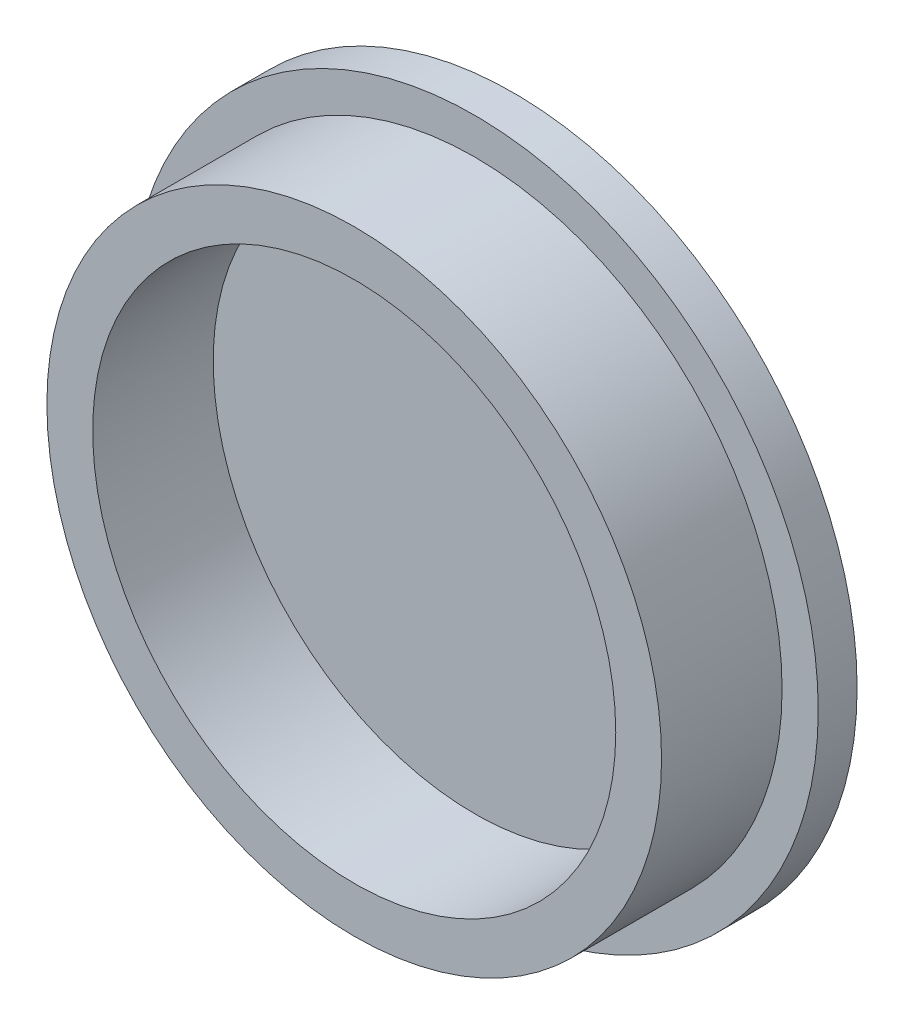
ISO-10303-21;
HEADER;
FILE_DESCRIPTION(('STEP AP214'),'2;1');
FILE_NAME('part.step','',(''),(''),'','','');
FILE_SCHEMA(('AUTOMOTIVE_DESIGN { 1 0 10303 214 1 1 1 1 }'));
ENDSEC;
DATA;
#1=APPLICATION_CONTEXT('core data for automotive mechanical design processes');
#2=APPLICATION_PROTOCOL_DEFINITION('international standard','automotive_design',2000,#1);
#3=PRODUCT_CONTEXT('',#1,'mechanical');
#4=PRODUCT('Part','Part','',(#3));
#5=PRODUCT_RELATED_PRODUCT_CATEGORY('part','',(#4));
#6=PRODUCT_DEFINITION_FORMATION('','',#4);
#7=PRODUCT_DEFINITION_CONTEXT('part definition',#1,'design');
#8=PRODUCT_DEFINITION('design','',#6,#7);
#9=PRODUCT_DEFINITION_SHAPE('','',#8);
#10=(LENGTH_UNIT() NAMED_UNIT(*) SI_UNIT(.MILLI.,.METRE.));
#11=(NAMED_UNIT(*) PLANE_ANGLE_UNIT() SI_UNIT($,.RADIAN.));
#12=(NAMED_UNIT(*) SI_UNIT($,.STERADIAN.) SOLID_ANGLE_UNIT());
#13=UNCERTAINTY_MEASURE_WITH_UNIT(LENGTH_MEASURE(1.E-05),#10,'distance_accuracy_value','');
#14=(GEOMETRIC_REPRESENTATION_CONTEXT(3) GLOBAL_UNCERTAINTY_ASSIGNED_CONTEXT((#13)) GLOBAL_UNIT_ASSIGNED_CONTEXT((#10,
#11,#12)) REPRESENTATION_CONTEXT('',''));
#15=CARTESIAN_POINT('',(0.,0.,0.));
#16=DIRECTION('',(0.,0.,1.));
#17=DIRECTION('',(1.,0.,0.));
#18=AXIS2_PLACEMENT_3D('',#15,#16,#17);
#19=CARTESIAN_POINT('',(0.,0.,-14.2658212290503));
#20=DIRECTION('',(0.,0.,1.));
#21=DIRECTION('',(1.,0.,0.));
#22=AXIS2_PLACEMENT_3D('',#19,#20,#21);
#23=PLANE('',#22);
#24=CARTESIAN_POINT('',(0.,0.,-14.2658212290503));
#25=DIRECTION('',(0.,0.,1.));
#26=DIRECTION('',(1.,0.,0.));
#27=AXIS2_PLACEMENT_3D('',#24,#25,#26);
#28=CIRCLE('',#27,57.);
#29=CARTESIAN_POINT('',(57.,0.,-14.2658212290503));
#30=VERTEX_POINT('',#29);
#31=EDGE_CURVE('E10',#30,#30,#28,.T.);
#32=ORIENTED_EDGE('',*,*,#31,.F.);
#33=EDGE_LOOP('',(#32));
#34=FACE_BOUND('',#33,.T.);
#35=ADVANCED_FACE('F39',(#34),#23,.F.);
#36=CARTESIAN_POINT('',(0.,0.,42.9870167597765));
#37=DIRECTION('',(0.,0.,1.));
#38=DIRECTION('',(1.,0.,0.));
#39=AXIS2_PLACEMENT_3D('',#36,#37,#38);
#40=CYLINDRICAL_SURFACE('',#39,57.);
#41=CARTESIAN_POINT('',(0.,0.,-7.81582122905028));
#42=DIRECTION('',(0.,0.,1.));
#43=DIRECTION('',(1.,0.,0.));
#44=AXIS2_PLACEMENT_3D('',#41,#42,#43);
#45=CIRCLE('',#44,57.);
#46=CARTESIAN_POINT('',(57.,0.,-7.81582122905028));
#47=VERTEX_POINT('',#46);
#48=EDGE_CURVE('E46',#47,#47,#45,.T.);
#49=ORIENTED_EDGE('',*,*,#48,.F.);
#50=EDGE_LOOP('',(#49));
#51=FACE_BOUND('',#50,.T.);
#52=ORIENTED_EDGE('',*,*,#31,.T.);
#53=EDGE_LOOP('',(#52));
#54=FACE_BOUND('',#53,.T.);
#55=ADVANCED_FACE('F93',(#51,#54),#40,.T.);
#56=CARTESIAN_POINT('',(0.,57.,-7.81582122905028));
#57=DIRECTION('',(0.,0.,-1.));
#58=DIRECTION('',(-1.,0.,0.));
#59=AXIS2_PLACEMENT_3D('',#56,#57,#58);
#60=PLANE('',#59);
#61=CARTESIAN_POINT('',(0.,0.,-7.81582122905028));
#62=DIRECTION('',(0.,0.,1.));
#63=DIRECTION('',(1.,0.,0.));
#64=AXIS2_PLACEMENT_3D('',#61,#62,#63);
#65=CIRCLE('',#64,51.);
#66=CARTESIAN_POINT('',(51.,0.,-7.81582122905028));
#67=VERTEX_POINT('',#66);
#68=EDGE_CURVE('E51',#67,#67,#65,.T.);
#69=ORIENTED_EDGE('',*,*,#68,.F.);
#70=EDGE_LOOP('',(#69));
#71=FACE_BOUND('',#70,.T.);
#72=ORIENTED_EDGE('',*,*,#48,.T.);
#73=EDGE_LOOP('',(#72));
#74=FACE_BOUND('',#73,.T.);
#75=ADVANCED_FACE('F88',(#71,#74),#60,.F.);
#76=CARTESIAN_POINT('',(0.,0.,42.9870167597765));
#77=DIRECTION('',(0.,0.,1.));
#78=DIRECTION('',(1.,0.,0.));
#79=AXIS2_PLACEMENT_3D('',#76,#77,#78);
#80=CYLINDRICAL_SURFACE('',#79,51.);
#81=CARTESIAN_POINT('',(0.,0.,12.1841787709497));
#82=DIRECTION('',(0.,0.,1.));
#83=DIRECTION('',(1.,0.,0.));
#84=AXIS2_PLACEMENT_3D('',#81,#82,#83);
#85=CIRCLE('',#84,51.);
#86=CARTESIAN_POINT('',(51.,0.,12.1841787709497));
#87=VERTEX_POINT('',#86);
#88=EDGE_CURVE('E56',#87,#87,#85,.T.);
#89=ORIENTED_EDGE('',*,*,#88,.F.);
#90=EDGE_LOOP('',(#89));
#91=FACE_BOUND('',#90,.T.);
#92=ORIENTED_EDGE('',*,*,#68,.T.);
#93=EDGE_LOOP('',(#92));
#94=FACE_BOUND('',#93,.T.);
#95=ADVANCED_FACE('F82',(#91,#94),#80,.T.);
#96=CARTESIAN_POINT('',(0.,51.,12.1841787709497));
#97=DIRECTION('',(0.,0.,-1.));
#98=DIRECTION('',(-1.,0.,0.));
#99=AXIS2_PLACEMENT_3D('',#96,#97,#98);
#100=PLANE('',#99);
#101=CARTESIAN_POINT('',(0.,0.,12.1841787709497));
#102=DIRECTION('',(0.,0.,1.));
#103=DIRECTION('',(1.,0.,0.));
#104=AXIS2_PLACEMENT_3D('',#101,#102,#103);
#105=CIRCLE('',#104,43.4);
#106=CARTESIAN_POINT('',(43.4,0.,12.1841787709497));
#107=VERTEX_POINT('',#106);
#108=EDGE_CURVE('E62',#107,#107,#105,.T.);
#109=ORIENTED_EDGE('',*,*,#108,.F.);
#110=EDGE_LOOP('',(#109));
#111=FACE_BOUND('',#110,.T.);
#112=ORIENTED_EDGE('',*,*,#88,.T.);
#113=EDGE_LOOP('',(#112));
#114=FACE_BOUND('',#113,.T.);
#115=ADVANCED_FACE('F76',(#111,#114),#100,.F.);
#116=CARTESIAN_POINT('',(0.,0.,42.9870167597765));
#117=DIRECTION('',(0.,0.,1.));
#118=DIRECTION('',(1.,0.,0.));
#119=AXIS2_PLACEMENT_3D('',#116,#117,#118);
#120=CYLINDRICAL_SURFACE('',#119,43.4);
#121=CARTESIAN_POINT('',(0.,0.,-7.81582122905028));
#122=DIRECTION('',(0.,0.,1.));
#123=DIRECTION('',(1.,0.,0.));
#124=AXIS2_PLACEMENT_3D('',#121,#122,#123);
#125=CIRCLE('',#124,43.4);
#126=CARTESIAN_POINT('',(43.4,0.,-7.81582122905028));
#127=VERTEX_POINT('',#126);
#128=EDGE_CURVE('E66',#127,#127,#125,.T.);
#129=ORIENTED_EDGE('',*,*,#128,.F.);
#130=EDGE_LOOP('',(#129));
#131=FACE_BOUND('',#130,.T.);
#132=ORIENTED_EDGE('',*,*,#108,.T.);
#133=EDGE_LOOP('',(#132));
#134=FACE_BOUND('',#133,.T.);
#135=ADVANCED_FACE('F73',(#131,#134),#120,.F.);
#136=CARTESIAN_POINT('',(0.,43.4,-7.81582122905028));
#137=DIRECTION('',(0.,0.,-1.));
#138=DIRECTION('',(-1.,0.,0.));
#139=AXIS2_PLACEMENT_3D('',#136,#137,#138);
#140=PLANE('',#139);
#141=ORIENTED_EDGE('',*,*,#128,.T.);
#142=EDGE_LOOP('',(#141));
#143=FACE_BOUND('',#142,.T.);
#144=ADVANCED_FACE('F71',(#143),#140,.F.);
#145=CLOSED_SHELL('',(#35,#55,#75,#95,#115,#135,#144));
#146=MANIFOLD_SOLID_BREP('B2',#145);
#147=ADVANCED_BREP_SHAPE_REPRESENTATION('',(#18,#146),#14);
#148=SHAPE_DEFINITION_REPRESENTATION(#9,#147);
ENDSEC;
END-ISO-10303-21;
